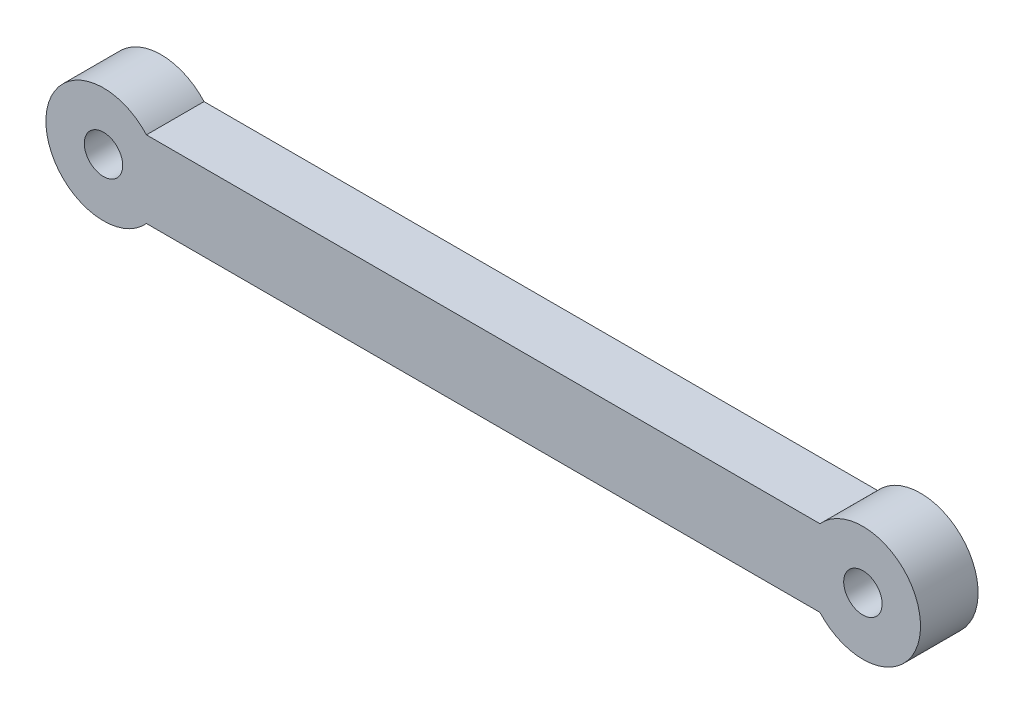
ISO-10303-21;
HEADER;
FILE_DESCRIPTION(('STEP AP214'),'2;1');
FILE_NAME('part.step','',(''),(''),'','','');
FILE_SCHEMA(('AUTOMOTIVE_DESIGN { 1 0 10303 214 1 1 1 1 }'));
ENDSEC;
DATA;
#1=APPLICATION_CONTEXT('core data for automotive mechanical design processes');
#2=APPLICATION_PROTOCOL_DEFINITION('international standard','automotive_design',2000,#1);
#3=PRODUCT_CONTEXT('',#1,'mechanical');
#4=PRODUCT('Part','Part','',(#3));
#5=PRODUCT_RELATED_PRODUCT_CATEGORY('part','',(#4));
#6=PRODUCT_DEFINITION_FORMATION('','',#4);
#7=PRODUCT_DEFINITION_CONTEXT('part definition',#1,'design');
#8=PRODUCT_DEFINITION('design','',#6,#7);
#9=PRODUCT_DEFINITION_SHAPE('','',#8);
#10=(LENGTH_UNIT() NAMED_UNIT(*) SI_UNIT(.MILLI.,.METRE.));
#11=(NAMED_UNIT(*) PLANE_ANGLE_UNIT() SI_UNIT($,.RADIAN.));
#12=(NAMED_UNIT(*) SI_UNIT($,.STERADIAN.) SOLID_ANGLE_UNIT());
#13=UNCERTAINTY_MEASURE_WITH_UNIT(LENGTH_MEASURE(1.E-05),#10,'distance_accuracy_value','');
#14=(GEOMETRIC_REPRESENTATION_CONTEXT(3) GLOBAL_UNCERTAINTY_ASSIGNED_CONTEXT((#13)) GLOBAL_UNIT_ASSIGNED_CONTEXT((#10,
#11,#12)) REPRESENTATION_CONTEXT('',''));
#15=CARTESIAN_POINT('',(0.,0.,0.));
#16=DIRECTION('',(0.,0.,1.));
#17=DIRECTION('',(1.,0.,0.));
#18=AXIS2_PLACEMENT_3D('',#15,#16,#17);
#19=CARTESIAN_POINT('',(-43.6387383016345,23.8299745520063,3.));
#20=DIRECTION('',(0.,0.,1.));
#21=DIRECTION('',(1.,0.,0.));
#22=AXIS2_PLACEMENT_3D('',#19,#20,#21);
#23=PLANE('',#22);
#24=CARTESIAN_POINT('',(-4.08873830163455,23.8299745520063,3.));
#25=DIRECTION('',(0.,0.,1.));
#26=DIRECTION('',(1.,0.,0.));
#27=AXIS2_PLACEMENT_3D('',#24,#25,#26);
#28=CIRCLE('',#27,1.);
#29=CARTESIAN_POINT('',(-3.08873830163455,23.8299745520063,3.));
#30=VERTEX_POINT('',#29);
#31=EDGE_CURVE('E103',#30,#30,#28,.T.);
#32=ORIENTED_EDGE('',*,*,#31,.F.);
#33=EDGE_LOOP('',(#32));
#34=FACE_BOUND('',#33,.T.);
#35=CARTESIAN_POINT('',(-43.6387383016345,23.8299745520063,3.));
#36=DIRECTION('',(0.,0.,1.));
#37=DIRECTION('',(1.,0.,0.));
#38=AXIS2_PLACEMENT_3D('',#35,#36,#37);
#39=CIRCLE('',#38,3.);
#40=CARTESIAN_POINT('',(-41.4026703241348,25.8299745520063,3.));
#41=VERTEX_POINT('',#40);
#42=CARTESIAN_POINT('',(-41.4026703241348,21.8299745520063,3.));
#43=VERTEX_POINT('',#42);
#44=EDGE_CURVE('E88',#41,#43,#39,.T.);
#45=ORIENTED_EDGE('',*,*,#44,.T.);
#46=DIRECTION('',(1.,0.,0.));
#47=VECTOR('',#46,1.);
#48=CARTESIAN_POINT('',(-41.4026703241348,21.8299745520063,3.));
#49=LINE('',#48,#47);
#50=CARTESIAN_POINT('',(-6.32480627913434,21.8299745520063,3.));
#51=VERTEX_POINT('',#50);
#52=EDGE_CURVE('E83',#43,#51,#49,.T.);
#53=ORIENTED_EDGE('',*,*,#52,.T.);
#54=CARTESIAN_POINT('',(-4.08873830163455,23.8299745520063,3.));
#55=DIRECTION('',(0.,0.,1.));
#56=DIRECTION('',(-1.,0.,0.));
#57=AXIS2_PLACEMENT_3D('',#54,#55,#56);
#58=CIRCLE('',#57,3.);
#59=CARTESIAN_POINT('',(-6.32480627913434,25.8299745520063,3.));
#60=VERTEX_POINT('',#59);
#61=EDGE_CURVE('E86',#51,#60,#58,.T.);
#62=ORIENTED_EDGE('',*,*,#61,.T.);
#63=DIRECTION('',(-1.,0.,0.));
#64=VECTOR('',#63,1.);
#65=CARTESIAN_POINT('',(-41.4026703241348,25.8299745520063,3.));
#66=LINE('',#65,#64);
#67=EDGE_CURVE('E53',#60,#41,#66,.T.);
#68=ORIENTED_EDGE('',*,*,#67,.T.);
#69=EDGE_LOOP('',(#45,#53,#62,#68));
#70=FACE_BOUND('',#69,.T.);
#71=CARTESIAN_POINT('',(-43.6387383016345,23.8299745520063,3.));
#72=DIRECTION('',(0.,0.,1.));
#73=DIRECTION('',(1.,0.,0.));
#74=AXIS2_PLACEMENT_3D('',#71,#72,#73);
#75=CIRCLE('',#74,0.999999999999991);
#76=CARTESIAN_POINT('',(-42.6387383016346,23.8299745520063,3.));
#77=VERTEX_POINT('',#76);
#78=EDGE_CURVE('E118',#77,#77,#75,.T.);
#79=ORIENTED_EDGE('',*,*,#78,.F.);
#80=EDGE_LOOP('',(#79));
#81=FACE_BOUND('',#80,.T.);
#82=ADVANCED_FACE('F36',(#34,#70,#81),#23,.T.);
#83=CARTESIAN_POINT('',(-43.6387383016345,23.8299745520063,0.));
#84=DIRECTION('',(0.,0.,1.));
#85=DIRECTION('',(1.,0.,0.));
#86=AXIS2_PLACEMENT_3D('',#83,#84,#85);
#87=PLANE('',#86);
#88=CARTESIAN_POINT('',(-43.6387383016345,23.8299745520063,0.));
#89=DIRECTION('',(0.,0.,1.));
#90=DIRECTION('',(1.,0.,0.));
#91=AXIS2_PLACEMENT_3D('',#88,#89,#90);
#92=CIRCLE('',#91,3.);
#93=CARTESIAN_POINT('',(-41.4026703241348,25.8299745520063,0.));
#94=VERTEX_POINT('',#93);
#95=CARTESIAN_POINT('',(-41.4026703241348,21.8299745520063,0.));
#96=VERTEX_POINT('',#95);
#97=EDGE_CURVE('E100',#94,#96,#92,.T.);
#98=ORIENTED_EDGE('',*,*,#97,.F.);
#99=DIRECTION('',(-1.,0.,0.));
#100=VECTOR('',#99,1.);
#101=CARTESIAN_POINT('',(-41.4026703241348,25.8299745520063,0.));
#102=LINE('',#101,#100);
#103=CARTESIAN_POINT('',(-6.32480627913434,25.8299745520063,0.));
#104=VERTEX_POINT('',#103);
#105=EDGE_CURVE('E76',#104,#94,#102,.T.);
#106=ORIENTED_EDGE('',*,*,#105,.F.);
#107=CARTESIAN_POINT('',(-4.08873830163455,23.8299745520063,0.));
#108=DIRECTION('',(0.,0.,1.));
#109=DIRECTION('',(-1.,0.,0.));
#110=AXIS2_PLACEMENT_3D('',#107,#108,#109);
#111=CIRCLE('',#110,3.);
#112=CARTESIAN_POINT('',(-6.32480627913434,21.8299745520063,0.));
#113=VERTEX_POINT('',#112);
#114=EDGE_CURVE('E70',#113,#104,#111,.T.);
#115=ORIENTED_EDGE('',*,*,#114,.F.);
#116=DIRECTION('',(1.,0.,0.));
#117=VECTOR('',#116,1.);
#118=CARTESIAN_POINT('',(-41.4026703241348,21.8299745520063,0.));
#119=LINE('',#118,#117);
#120=EDGE_CURVE('E92',#96,#113,#119,.T.);
#121=ORIENTED_EDGE('',*,*,#120,.F.);
#122=EDGE_LOOP('',(#98,#106,#115,#121));
#123=FACE_BOUND('',#122,.T.);
#124=CARTESIAN_POINT('',(-4.08873830163455,23.8299745520063,0.));
#125=DIRECTION('',(0.,0.,1.));
#126=DIRECTION('',(1.,0.,0.));
#127=AXIS2_PLACEMENT_3D('',#124,#125,#126);
#128=CIRCLE('',#127,1.);
#129=CARTESIAN_POINT('',(-3.08873830163455,23.8299745520063,0.));
#130=VERTEX_POINT('',#129);
#131=EDGE_CURVE('E115',#130,#130,#128,.T.);
#132=ORIENTED_EDGE('',*,*,#131,.T.);
#133=EDGE_LOOP('',(#132));
#134=FACE_BOUND('',#133,.T.);
#135=CARTESIAN_POINT('',(-43.6387383016345,23.8299745520063,0.));
#136=DIRECTION('',(0.,0.,1.));
#137=DIRECTION('',(1.,0.,0.));
#138=AXIS2_PLACEMENT_3D('',#135,#136,#137);
#139=CIRCLE('',#138,0.999999999999991);
#140=CARTESIAN_POINT('',(-42.6387383016346,23.8299745520063,0.));
#141=VERTEX_POINT('',#140);
#142=EDGE_CURVE('E121',#141,#141,#139,.T.);
#143=ORIENTED_EDGE('',*,*,#142,.T.);
#144=EDGE_LOOP('',(#143));
#145=FACE_BOUND('',#144,.T.);
#146=ADVANCED_FACE('F111',(#123,#134,#145),#87,.F.);
#147=CARTESIAN_POINT('',(-43.6387383016345,23.8299745520063,3.));
#148=DIRECTION('',(0.,0.,-1.));
#149=DIRECTION('',(-1.,0.,0.));
#150=AXIS2_PLACEMENT_3D('',#147,#148,#149);
#151=CYLINDRICAL_SURFACE('',#150,3.);
#152=ORIENTED_EDGE('',*,*,#97,.T.);
#153=DIRECTION('',(0.,0.,-1.));
#154=VECTOR('',#153,1.);
#155=CARTESIAN_POINT('',(-41.4026703241348,21.8299745520063,3.));
#156=LINE('',#155,#154);
#157=EDGE_CURVE('E11',#43,#96,#156,.T.);
#158=ORIENTED_EDGE('',*,*,#157,.F.);
#159=ORIENTED_EDGE('',*,*,#44,.F.);
#160=DIRECTION('',(0.,0.,-1.));
#161=VECTOR('',#160,1.);
#162=CARTESIAN_POINT('',(-41.4026703241348,25.8299745520063,3.));
#163=LINE('',#162,#161);
#164=EDGE_CURVE('E96',#41,#94,#163,.T.);
#165=ORIENTED_EDGE('',*,*,#164,.T.);
#166=EDGE_LOOP('',(#152,#158,#159,#165));
#167=FACE_BOUND('',#166,.T.);
#168=ADVANCED_FACE('F38',(#167),#151,.T.);
#169=CARTESIAN_POINT('',(-41.4026703241348,21.8299745520063,3.));
#170=DIRECTION('',(0.,1.,0.));
#171=DIRECTION('',(-1.,0.,0.));
#172=AXIS2_PLACEMENT_3D('',#169,#170,#171);
#173=PLANE('',#172);
#174=ORIENTED_EDGE('',*,*,#120,.T.);
#175=DIRECTION('',(0.,0.,-1.));
#176=VECTOR('',#175,1.);
#177=CARTESIAN_POINT('',(-6.32480627913434,21.8299745520063,3.));
#178=LINE('',#177,#176);
#179=EDGE_CURVE('E45',#51,#113,#178,.T.);
#180=ORIENTED_EDGE('',*,*,#179,.F.);
#181=ORIENTED_EDGE('',*,*,#52,.F.);
#182=ORIENTED_EDGE('',*,*,#157,.T.);
#183=EDGE_LOOP('',(#174,#180,#181,#182));
#184=FACE_BOUND('',#183,.T.);
#185=ADVANCED_FACE('F91',(#184),#173,.F.);
#186=CARTESIAN_POINT('',(-4.08873830163455,23.8299745520063,3.));
#187=DIRECTION('',(0.,0.,-1.));
#188=DIRECTION('',(-1.,0.,0.));
#189=AXIS2_PLACEMENT_3D('',#186,#187,#188);
#190=CYLINDRICAL_SURFACE('',#189,3.);
#191=ORIENTED_EDGE('',*,*,#114,.T.);
#192=DIRECTION('',(0.,0.,-1.));
#193=VECTOR('',#192,1.);
#194=CARTESIAN_POINT('',(-6.32480627913434,25.8299745520063,3.));
#195=LINE('',#194,#193);
#196=EDGE_CURVE('E93',#60,#104,#195,.T.);
#197=ORIENTED_EDGE('',*,*,#196,.F.);
#198=ORIENTED_EDGE('',*,*,#61,.F.);
#199=ORIENTED_EDGE('',*,*,#179,.T.);
#200=EDGE_LOOP('',(#191,#197,#198,#199));
#201=FACE_BOUND('',#200,.T.);
#202=ADVANCED_FACE('F94',(#201),#190,.T.);
#203=CARTESIAN_POINT('',(-41.4026703241348,25.8299745520063,3.));
#204=DIRECTION('',(0.,-1.,0.));
#205=DIRECTION('',(0.,0.,-1.));
#206=AXIS2_PLACEMENT_3D('',#203,#204,#205);
#207=PLANE('',#206);
#208=ORIENTED_EDGE('',*,*,#105,.T.);
#209=ORIENTED_EDGE('',*,*,#164,.F.);
#210=ORIENTED_EDGE('',*,*,#67,.F.);
#211=ORIENTED_EDGE('',*,*,#196,.T.);
#212=EDGE_LOOP('',(#208,#209,#210,#211));
#213=FACE_BOUND('',#212,.T.);
#214=ADVANCED_FACE('F108',(#213),#207,.F.);
#215=CARTESIAN_POINT('',(-4.08873830163455,23.8299745520063,3.));
#216=DIRECTION('',(0.,0.,-1.));
#217=DIRECTION('',(-1.,0.,0.));
#218=AXIS2_PLACEMENT_3D('',#215,#216,#217);
#219=CYLINDRICAL_SURFACE('',#218,1.);
#220=ORIENTED_EDGE('',*,*,#31,.T.);
#221=EDGE_LOOP('',(#220));
#222=FACE_BOUND('',#221,.T.);
#223=ORIENTED_EDGE('',*,*,#131,.F.);
#224=EDGE_LOOP('',(#223));
#225=FACE_BOUND('',#224,.T.);
#226=ADVANCED_FACE('F138',(#222,#225),#219,.F.);
#227=CARTESIAN_POINT('',(-43.6387383016345,23.8299745520063,3.));
#228=DIRECTION('',(0.,0.,-1.));
#229=DIRECTION('',(-1.,0.,0.));
#230=AXIS2_PLACEMENT_3D('',#227,#228,#229);
#231=CYLINDRICAL_SURFACE('',#230,0.999999999999991);
#232=ORIENTED_EDGE('',*,*,#78,.T.);
#233=EDGE_LOOP('',(#232));
#234=FACE_BOUND('',#233,.T.);
#235=ORIENTED_EDGE('',*,*,#142,.F.);
#236=EDGE_LOOP('',(#235));
#237=FACE_BOUND('',#236,.T.);
#238=ADVANCED_FACE('F127',(#234,#237),#231,.F.);
#239=CLOSED_SHELL('',(#82,#146,#168,#185,#202,#214,#226,#238));
#240=MANIFOLD_SOLID_BREP('B2',#239);
#241=ADVANCED_BREP_SHAPE_REPRESENTATION('',(#18,#240),#14);
#242=SHAPE_DEFINITION_REPRESENTATION(#9,#241);
ENDSEC;
END-ISO-10303-21;
